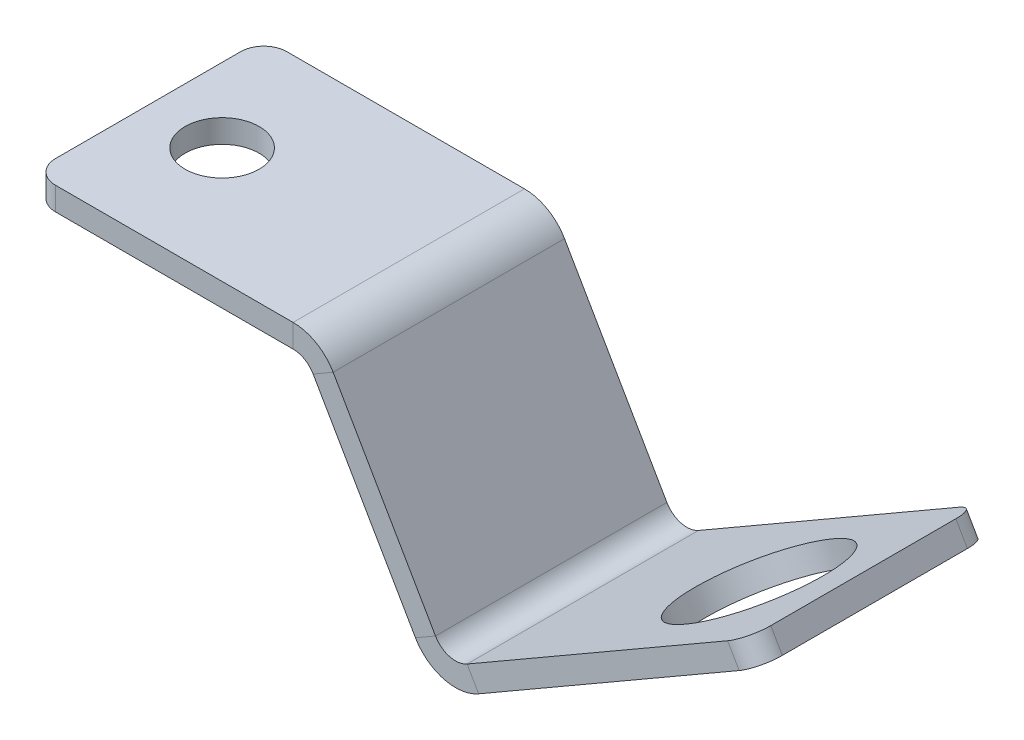
ISO-10303-21;
HEADER;
FILE_DESCRIPTION(('STEP AP214'),'2;1');
FILE_NAME('part.step','',(''),(''),'','','');
FILE_SCHEMA(('AUTOMOTIVE_DESIGN { 1 0 10303 214 1 1 1 1 }'));
ENDSEC;
DATA;
#1=APPLICATION_CONTEXT('core data for automotive mechanical design processes');
#2=APPLICATION_PROTOCOL_DEFINITION('international standard','automotive_design',2000,#1);
#3=PRODUCT_CONTEXT('',#1,'mechanical');
#4=PRODUCT('Part','Part','',(#3));
#5=PRODUCT_RELATED_PRODUCT_CATEGORY('part','',(#4));
#6=PRODUCT_DEFINITION_FORMATION('','',#4);
#7=PRODUCT_DEFINITION_CONTEXT('part definition',#1,'design');
#8=PRODUCT_DEFINITION('design','',#6,#7);
#9=PRODUCT_DEFINITION_SHAPE('','',#8);
#10=(LENGTH_UNIT() NAMED_UNIT(*) SI_UNIT(.MILLI.,.METRE.));
#11=(NAMED_UNIT(*) PLANE_ANGLE_UNIT() SI_UNIT($,.RADIAN.));
#12=(NAMED_UNIT(*) SI_UNIT($,.STERADIAN.) SOLID_ANGLE_UNIT());
#13=UNCERTAINTY_MEASURE_WITH_UNIT(LENGTH_MEASURE(1.E-05),#10,'distance_accuracy_value','');
#14=(GEOMETRIC_REPRESENTATION_CONTEXT(3) GLOBAL_UNCERTAINTY_ASSIGNED_CONTEXT((#13)) GLOBAL_UNIT_ASSIGNED_CONTEXT((#10,
#11,#12)) REPRESENTATION_CONTEXT('',''));
#15=CARTESIAN_POINT('',(0.,0.,0.));
#16=DIRECTION('',(0.,0.,1.));
#17=DIRECTION('',(1.,0.,0.));
#18=AXIS2_PLACEMENT_3D('',#15,#16,#17);
#19=CARTESIAN_POINT('',(37.8544128953231,-32.995567884187,15.875));
#20=DIRECTION('',(0.,0.,-1.));
#21=DIRECTION('',(-1.,0.,0.));
#22=AXIS2_PLACEMENT_3D('',#19,#20,#21);
#23=PLANE('',#22);
#24=DIRECTION('',(-0.866025403784436,-0.500000000000005,0.));
#25=VECTOR('',#24,1.);
#26=CARTESIAN_POINT('',(34.6794128953231,-27.4963065701559,15.875));
#27=LINE('',#26,#25);
#28=CARTESIAN_POINT('',(34.6794128953231,-27.4963065701559,15.875));
#29=VERTEX_POINT('',#28);
#30=CARTESIAN_POINT('',(31.9297822383075,-29.0838065701559,15.875));
#31=VERTEX_POINT('',#30);
#32=EDGE_CURVE('E254',#29,#31,#27,.T.);
#33=ORIENTED_EDGE('',*,*,#32,.F.);
#34=DIRECTION('',(0.500000000000004,-0.866025403784436,0.));
#35=VECTOR('',#34,1.);
#36=CARTESIAN_POINT('',(13.1867661191536,9.73004963530073,15.875));
#37=LINE('',#36,#35);
#38=CARTESIAN_POINT('',(20.6375,-3.17499999999997,15.875));
#39=VERTEX_POINT('',#38);
#40=EDGE_CURVE('E262',#39,#29,#37,.T.);
#41=ORIENTED_EDGE('',*,*,#40,.F.);
#42=DIRECTION('',(-0.866025403784436,-0.500000000000004,0.));
#43=VECTOR('',#42,1.);
#44=CARTESIAN_POINT('',(17.8878693429844,-4.76249999999999,15.875));
#45=LINE('',#44,#43);
#46=CARTESIAN_POINT('',(17.8878693429844,-4.76249999999999,15.875));
#47=VERTEX_POINT('',#46);
#48=EDGE_CURVE('E273',#47,#39,#45,.F.);
#49=ORIENTED_EDGE('',*,*,#48,.F.);
#50=DIRECTION('',(-0.500000000000004,0.866025403784436,0.));
#51=VECTOR('',#50,1.);
#52=CARTESIAN_POINT('',(35.1047822383075,-34.583067884187,15.875));
#53=LINE('',#52,#51);
#54=EDGE_CURVE('E267',#47,#31,#53,.F.);
#55=ORIENTED_EDGE('',*,*,#54,.T.);
#56=EDGE_LOOP('',(#33,#41,#49,#55));
#57=FACE_BOUND('',#56,.T.);
#58=ADVANCED_FACE('F79',(#57),#23,.F.);
#59=CARTESIAN_POINT('',(19.7209564476615,-1.58749999999999,-15.875));
#60=DIRECTION('',(0.,0.,1.));
#61=DIRECTION('',(1.,0.,0.));
#62=AXIS2_PLACEMENT_3D('',#59,#60,#61);
#63=PLANE('',#62);
#64=DIRECTION('',(-0.866025403784436,-0.500000000000005,0.));
#65=VECTOR('',#64,1.);
#66=CARTESIAN_POINT('',(34.6794128953231,-27.4963065701559,-15.875));
#67=LINE('',#66,#65);
#68=CARTESIAN_POINT('',(34.6794128953231,-27.4963065701559,-15.875));
#69=VERTEX_POINT('',#68);
#70=CARTESIAN_POINT('',(31.9297822383075,-29.0838065701559,-15.875));
#71=VERTEX_POINT('',#70);
#72=EDGE_CURVE('E247',#69,#71,#67,.T.);
#73=ORIENTED_EDGE('',*,*,#72,.T.);
#74=DIRECTION('',(0.500000000000004,-0.866025403784436,0.));
#75=VECTOR('',#74,1.);
#76=CARTESIAN_POINT('',(16.9713257906459,-3.175,-15.875));
#77=LINE('',#76,#75);
#78=CARTESIAN_POINT('',(17.8878693429844,-4.76249999999999,-15.875));
#79=VERTEX_POINT('',#78);
#80=EDGE_CURVE('E265',#71,#79,#77,.F.);
#81=ORIENTED_EDGE('',*,*,#80,.T.);
#82=DIRECTION('',(-0.866025403784436,-0.500000000000004,0.));
#83=VECTOR('',#82,1.);
#84=CARTESIAN_POINT('',(20.6375,-3.17499999999997,-15.875));
#85=LINE('',#84,#83);
#86=CARTESIAN_POINT('',(20.6375,-3.17499999999997,-15.875));
#87=VERTEX_POINT('',#86);
#88=EDGE_CURVE('E257',#79,#87,#85,.F.);
#89=ORIENTED_EDGE('',*,*,#88,.T.);
#90=DIRECTION('',(-0.500000000000004,0.866025403784436,0.));
#91=VECTOR('',#90,1.);
#92=CARTESIAN_POINT('',(13.1867661191536,9.73004963530073,-15.875));
#93=LINE('',#92,#91);
#94=EDGE_CURVE('E259',#69,#87,#93,.T.);
#95=ORIENTED_EDGE('',*,*,#94,.F.);
#96=EDGE_LOOP('',(#73,#81,#89,#95));
#97=FACE_BOUND('',#96,.T.);
#98=ADVANCED_FACE('F394',(#97),#63,.F.);
#99=CARTESIAN_POINT('',(13.1867661191536,9.73004963530073,0.));
#100=DIRECTION('',(-0.866025403784436,-0.500000000000004,0.));
#101=DIRECTION('',(0.500000000000004,-0.866025403784436,0.));
#102=AXIS2_PLACEMENT_3D('',#99,#100,#101);
#103=PLANE('',#102);
#104=DIRECTION('',(0.,0.,-1.));
#105=VECTOR('',#104,1.);
#106=CARTESIAN_POINT('',(34.6794128953231,-27.4963065701559,-15.875));
#107=LINE('',#106,#105);
#108=EDGE_CURVE('E251',#69,#29,#107,.F.);
#109=ORIENTED_EDGE('',*,*,#108,.F.);
#110=ORIENTED_EDGE('',*,*,#94,.T.);
#111=DIRECTION('',(0.,0.,1.));
#112=VECTOR('',#111,1.);
#113=CARTESIAN_POINT('',(20.6375,-3.17499999999997,-15.875));
#114=LINE('',#113,#112);
#115=EDGE_CURVE('E270',#39,#87,#114,.F.);
#116=ORIENTED_EDGE('',*,*,#115,.F.);
#117=ORIENTED_EDGE('',*,*,#40,.T.);
#118=EDGE_LOOP('',(#109,#110,#116,#117));
#119=FACE_BOUND('',#118,.T.);
#120=ADVANCED_FACE('F386',(#119),#103,.F.);
#121=CARTESIAN_POINT('',(10.437135462138,8.14254963530071,0.));
#122=DIRECTION('',(-0.866025403784436,-0.500000000000004,0.));
#123=DIRECTION('',(0.500000000000004,-0.866025403784436,0.));
#124=AXIS2_PLACEMENT_3D('',#121,#122,#123);
#125=PLANE('',#124);
#126=ORIENTED_EDGE('',*,*,#80,.F.);
#127=DIRECTION('',(0.,0.,-1.));
#128=VECTOR('',#127,1.);
#129=CARTESIAN_POINT('',(31.9297822383075,-29.0838065701559,-15.875));
#130=LINE('',#129,#128);
#131=EDGE_CURVE('E199',#71,#31,#130,.F.);
#132=ORIENTED_EDGE('',*,*,#131,.T.);
#133=ORIENTED_EDGE('',*,*,#54,.F.);
#134=DIRECTION('',(0.,0.,1.));
#135=VECTOR('',#134,1.);
#136=CARTESIAN_POINT('',(17.8878693429844,-4.76249999999999,-15.875));
#137=LINE('',#136,#135);
#138=EDGE_CURVE('E276',#79,#47,#137,.T.);
#139=ORIENTED_EDGE('',*,*,#138,.F.);
#140=EDGE_LOOP('',(#126,#132,#133,#139));
#141=FACE_BOUND('',#140,.T.);
#142=ADVANCED_FACE('F379',(#141),#125,.T.);
#143=CARTESIAN_POINT('',(-20.6375,-3.175,15.875));
#144=DIRECTION('',(0.,0.,1.));
#145=DIRECTION('',(1.,0.,0.));
#146=AXIS2_PLACEMENT_3D('',#143,#144,#145);
#147=PLANE('',#146);
#148=DIRECTION('',(1.,0.,0.));
#149=VECTOR('',#148,1.);
#150=CARTESIAN_POINT('',(-20.6375,0.,15.875));
#151=LINE('',#150,#149);
#152=CARTESIAN_POINT('',(-17.4625,0.,15.875));
#153=VERTEX_POINT('',#152);
#154=CARTESIAN_POINT('',(15.1382386859688,0.,15.875));
#155=VERTEX_POINT('',#154);
#156=EDGE_CURVE('E314',#153,#155,#151,.T.);
#157=ORIENTED_EDGE('',*,*,#156,.F.);
#158=DIRECTION('',(0.,1.,0.));
#159=VECTOR('',#158,1.);
#160=CARTESIAN_POINT('',(-17.4625,-3.175,15.875));
#161=LINE('',#160,#159);
#162=CARTESIAN_POINT('',(-17.4625,-3.175,15.875));
#163=VERTEX_POINT('',#162);
#164=EDGE_CURVE('E13',#153,#163,#161,.F.);
#165=ORIENTED_EDGE('',*,*,#164,.T.);
#166=DIRECTION('',(1.,0.,0.));
#167=VECTOR('',#166,1.);
#168=CARTESIAN_POINT('',(-20.6375,-3.175,15.875));
#169=LINE('',#168,#167);
#170=CARTESIAN_POINT('',(15.1382386859688,-3.175,15.875));
#171=VERTEX_POINT('',#170);
#172=EDGE_CURVE('E305',#163,#171,#169,.T.);
#173=ORIENTED_EDGE('',*,*,#172,.T.);
#174=DIRECTION('',(0.,1.,0.));
#175=VECTOR('',#174,1.);
#176=CARTESIAN_POINT('',(15.1382386859688,-3.175,15.875));
#177=LINE('',#176,#175);
#178=EDGE_CURVE('E287',#171,#155,#177,.T.);
#179=ORIENTED_EDGE('',*,*,#178,.T.);
#180=EDGE_LOOP('',(#157,#165,#173,#179));
#181=FACE_BOUND('',#180,.T.);
#182=ADVANCED_FACE('F366',(#181),#147,.T.);
#183=CARTESIAN_POINT('',(0.,-3.175,0.));
#184=DIRECTION('',(0.,1.,0.));
#185=DIRECTION('',(0.,0.,1.));
#186=AXIS2_PLACEMENT_3D('',#183,#184,#185);
#187=PLANE('',#186);
#188=CARTESIAN_POINT('',(-10.4775,-3.175,0.));
#189=DIRECTION('',(0.,1.,0.));
#190=DIRECTION('',(0.,0.,1.));
#191=AXIS2_PLACEMENT_3D('',#188,#189,#190);
#192=CIRCLE('',#191,5.08);
#193=CARTESIAN_POINT('',(-10.4775,-3.175,5.08));
#194=VERTEX_POINT('',#193);
#195=EDGE_CURVE('E244',#194,#194,#192,.T.);
#196=ORIENTED_EDGE('',*,*,#195,.T.);
#197=EDGE_LOOP('',(#196));
#198=FACE_BOUND('',#197,.T.);
#199=DIRECTION('',(0.,0.,1.));
#200=VECTOR('',#199,1.);
#201=CARTESIAN_POINT('',(-20.6375,-3.175,-15.875));
#202=LINE('',#201,#200);
#203=CARTESIAN_POINT('',(-20.6375,-3.175,-12.7));
#204=VERTEX_POINT('',#203);
#205=CARTESIAN_POINT('',(-20.6375,-3.175,12.7));
#206=VERTEX_POINT('',#205);
#207=EDGE_CURVE('E303',#204,#206,#202,.T.);
#208=ORIENTED_EDGE('',*,*,#207,.F.);
#209=CARTESIAN_POINT('',(-17.4625,-3.175,-12.7));
#210=DIRECTION('',(0.,1.,0.));
#211=DIRECTION('',(0.,0.,1.));
#212=AXIS2_PLACEMENT_3D('',#209,#210,#211);
#213=CIRCLE('',#212,3.175);
#214=CARTESIAN_POINT('',(-17.4625,-3.175,-15.875));
#215=VERTEX_POINT('',#214);
#216=EDGE_CURVE('E87',#204,#215,#213,.F.);
#217=ORIENTED_EDGE('',*,*,#216,.T.);
#218=DIRECTION('',(-1.,0.,0.));
#219=VECTOR('',#218,1.);
#220=CARTESIAN_POINT('',(-20.6375,-3.175,-15.875));
#221=LINE('',#220,#219);
#222=CARTESIAN_POINT('',(15.1382386859688,-3.175,-15.875));
#223=VERTEX_POINT('',#222);
#224=EDGE_CURVE('E308',#223,#215,#221,.T.);
#225=ORIENTED_EDGE('',*,*,#224,.F.);
#226=DIRECTION('',(0.,0.,1.));
#227=VECTOR('',#226,1.);
#228=CARTESIAN_POINT('',(15.1382386859688,-3.175,15.875));
#229=LINE('',#228,#227);
#230=EDGE_CURVE('E293',#171,#223,#229,.F.);
#231=ORIENTED_EDGE('',*,*,#230,.F.);
#232=ORIENTED_EDGE('',*,*,#172,.F.);
#233=CARTESIAN_POINT('',(-17.4625,-3.175,12.7));
#234=DIRECTION('',(0.,1.,0.));
#235=DIRECTION('',(0.,0.,1.));
#236=AXIS2_PLACEMENT_3D('',#233,#234,#235);
#237=CIRCLE('',#236,3.175);
#238=EDGE_CURVE('E99',#163,#206,#237,.F.);
#239=ORIENTED_EDGE('',*,*,#238,.T.);
#240=EDGE_LOOP('',(#208,#217,#225,#231,#232,#239));
#241=FACE_BOUND('',#240,.T.);
#242=ADVANCED_FACE('F348',(#198,#241),#187,.F.);
#243=CARTESIAN_POINT('',(0.,0.,0.));
#244=DIRECTION('',(0.,1.,0.));
#245=DIRECTION('',(0.,0.,1.));
#246=AXIS2_PLACEMENT_3D('',#243,#244,#245);
#247=PLANE('',#246);
#248=CARTESIAN_POINT('',(-10.4775,0.,0.));
#249=DIRECTION('',(0.,1.,0.));
#250=DIRECTION('',(0.,0.,1.));
#251=AXIS2_PLACEMENT_3D('',#248,#249,#250);
#252=CIRCLE('',#251,5.08);
#253=CARTESIAN_POINT('',(-10.4775,0.,5.08));
#254=VERTEX_POINT('',#253);
#255=EDGE_CURVE('E418',#254,#254,#252,.T.);
#256=ORIENTED_EDGE('',*,*,#255,.F.);
#257=EDGE_LOOP('',(#256));
#258=FACE_BOUND('',#257,.T.);
#259=DIRECTION('',(-1.,0.,0.));
#260=VECTOR('',#259,1.);
#261=CARTESIAN_POINT('',(-20.6375,0.,-15.875));
#262=LINE('',#261,#260);
#263=CARTESIAN_POINT('',(15.1382386859688,0.,-15.875));
#264=VERTEX_POINT('',#263);
#265=CARTESIAN_POINT('',(-17.4625,0.,-15.875));
#266=VERTEX_POINT('',#265);
#267=EDGE_CURVE('E306',#264,#266,#262,.T.);
#268=ORIENTED_EDGE('',*,*,#267,.T.);
#269=CARTESIAN_POINT('',(-17.4625,0.,-12.7));
#270=DIRECTION('',(0.,1.,0.));
#271=DIRECTION('',(0.,0.,1.));
#272=AXIS2_PLACEMENT_3D('',#269,#270,#271);
#273=CIRCLE('',#272,3.175);
#274=CARTESIAN_POINT('',(-20.6375,0.,-12.7));
#275=VERTEX_POINT('',#274);
#276=EDGE_CURVE('E339',#266,#275,#273,.T.);
#277=ORIENTED_EDGE('',*,*,#276,.T.);
#278=DIRECTION('',(0.,0.,1.));
#279=VECTOR('',#278,1.);
#280=CARTESIAN_POINT('',(-20.6375,0.,-15.875));
#281=LINE('',#280,#279);
#282=CARTESIAN_POINT('',(-20.6375,0.,12.7));
#283=VERTEX_POINT('',#282);
#284=EDGE_CURVE('E300',#275,#283,#281,.T.);
#285=ORIENTED_EDGE('',*,*,#284,.T.);
#286=CARTESIAN_POINT('',(-17.4625,0.,12.7));
#287=DIRECTION('',(0.,1.,0.));
#288=DIRECTION('',(0.,0.,1.));
#289=AXIS2_PLACEMENT_3D('',#286,#287,#288);
#290=CIRCLE('',#289,3.175);
#291=EDGE_CURVE('E337',#283,#153,#290,.T.);
#292=ORIENTED_EDGE('',*,*,#291,.T.);
#293=ORIENTED_EDGE('',*,*,#156,.T.);
#294=DIRECTION('',(0.,0.,1.));
#295=VECTOR('',#294,1.);
#296=CARTESIAN_POINT('',(15.1382386859688,0.,15.875));
#297=LINE('',#296,#295);
#298=EDGE_CURVE('E280',#155,#264,#297,.F.);
#299=ORIENTED_EDGE('',*,*,#298,.T.);
#300=EDGE_LOOP('',(#268,#277,#285,#292,#293,#299));
#301=FACE_BOUND('',#300,.T.);
#302=ADVANCED_FACE('F360',(#258,#301),#247,.T.);
#303=CARTESIAN_POINT('',(-20.6375,-3.175,-15.875));
#304=DIRECTION('',(-1.,0.,0.));
#305=DIRECTION('',(0.,0.,1.));
#306=AXIS2_PLACEMENT_3D('',#303,#304,#305);
#307=PLANE('',#306);
#308=ORIENTED_EDGE('',*,*,#284,.F.);
#309=DIRECTION('',(0.,1.,0.));
#310=VECTOR('',#309,1.);
#311=CARTESIAN_POINT('',(-20.6375,-3.175,-12.7));
#312=LINE('',#311,#310);
#313=EDGE_CURVE('E344',#275,#204,#312,.F.);
#314=ORIENTED_EDGE('',*,*,#313,.T.);
#315=ORIENTED_EDGE('',*,*,#207,.T.);
#316=DIRECTION('',(0.,1.,0.));
#317=VECTOR('',#316,1.);
#318=CARTESIAN_POINT('',(-20.6375,-3.175,12.7));
#319=LINE('',#318,#317);
#320=EDGE_CURVE('E341',#206,#283,#319,.T.);
#321=ORIENTED_EDGE('',*,*,#320,.T.);
#322=EDGE_LOOP('',(#308,#314,#315,#321));
#323=FACE_BOUND('',#322,.T.);
#324=ADVANCED_FACE('F362',(#323),#307,.T.);
#325=CARTESIAN_POINT('',(-20.6375,-3.175,-15.875));
#326=DIRECTION('',(0.,0.,-1.));
#327=DIRECTION('',(-1.,0.,0.));
#328=AXIS2_PLACEMENT_3D('',#325,#326,#327);
#329=PLANE('',#328);
#330=ORIENTED_EDGE('',*,*,#224,.T.);
#331=DIRECTION('',(0.,1.,0.));
#332=VECTOR('',#331,1.);
#333=CARTESIAN_POINT('',(-17.4625,-3.175,-15.875));
#334=LINE('',#333,#332);
#335=EDGE_CURVE('E334',#215,#266,#334,.T.);
#336=ORIENTED_EDGE('',*,*,#335,.T.);
#337=ORIENTED_EDGE('',*,*,#267,.F.);
#338=DIRECTION('',(0.,1.,0.));
#339=VECTOR('',#338,1.);
#340=CARTESIAN_POINT('',(15.1382386859688,-3.175,-15.875));
#341=LINE('',#340,#339);
#342=EDGE_CURVE('E297',#223,#264,#341,.T.);
#343=ORIENTED_EDGE('',*,*,#342,.F.);
#344=EDGE_LOOP('',(#330,#336,#337,#343));
#345=FACE_BOUND('',#344,.T.);
#346=ADVANCED_FACE('F355',(#345),#329,.T.);
#347=CARTESIAN_POINT('',(15.1382386859688,-6.35,-15.875));
#348=DIRECTION('',(0.,0.,-1.));
#349=DIRECTION('',(-1.,0.,0.));
#350=AXIS2_PLACEMENT_3D('',#347,#348,#349);
#351=PLANE('',#350);
#352=ORIENTED_EDGE('',*,*,#88,.F.);
#353=CARTESIAN_POINT('',(15.1382386859688,-6.35,-15.875));
#354=DIRECTION('',(0.,0.,1.));
#355=DIRECTION('',(1.,0.,0.));
#356=AXIS2_PLACEMENT_3D('',#353,#354,#355);
#357=CIRCLE('',#356,3.175);
#358=EDGE_CURVE('E290',#223,#79,#357,.F.);
#359=ORIENTED_EDGE('',*,*,#358,.F.);
#360=ORIENTED_EDGE('',*,*,#342,.T.);
#361=CARTESIAN_POINT('',(15.1382386859688,-6.35,-15.875));
#362=DIRECTION('',(0.,0.,1.));
#363=DIRECTION('',(1.,0.,0.));
#364=AXIS2_PLACEMENT_3D('',#361,#362,#363);
#365=CIRCLE('',#364,6.35);
#366=EDGE_CURVE('E283',#264,#87,#365,.F.);
#367=ORIENTED_EDGE('',*,*,#366,.T.);
#368=EDGE_LOOP('',(#352,#359,#360,#367));
#369=FACE_BOUND('',#368,.T.);
#370=ADVANCED_FACE('F392',(#369),#351,.T.);
#371=CARTESIAN_POINT('',(15.1382386859688,-6.35,15.875));
#372=DIRECTION('',(0.,0.,-1.));
#373=DIRECTION('',(-1.,0.,0.));
#374=AXIS2_PLACEMENT_3D('',#371,#372,#373);
#375=PLANE('',#374);
#376=CARTESIAN_POINT('',(15.1382386859688,-6.35,15.875));
#377=DIRECTION('',(0.,0.,1.));
#378=DIRECTION('',(1.,0.,0.));
#379=AXIS2_PLACEMENT_3D('',#376,#377,#378);
#380=CIRCLE('',#379,3.175);
#381=EDGE_CURVE('E261',#47,#171,#380,.T.);
#382=ORIENTED_EDGE('',*,*,#381,.F.);
#383=ORIENTED_EDGE('',*,*,#48,.T.);
#384=CARTESIAN_POINT('',(15.1382386859688,-6.35,15.875));
#385=DIRECTION('',(0.,0.,1.));
#386=DIRECTION('',(1.,0.,0.));
#387=AXIS2_PLACEMENT_3D('',#384,#385,#386);
#388=CIRCLE('',#387,6.35);
#389=EDGE_CURVE('E284',#39,#155,#388,.T.);
#390=ORIENTED_EDGE('',*,*,#389,.T.);
#391=ORIENTED_EDGE('',*,*,#178,.F.);
#392=EDGE_LOOP('',(#382,#383,#390,#391));
#393=FACE_BOUND('',#392,.T.);
#394=ADVANCED_FACE('F370',(#393),#375,.F.);
#395=CARTESIAN_POINT('',(15.1382386859688,-6.35,15.875));
#396=DIRECTION('',(0.,0.,1.));
#397=DIRECTION('',(0.866025403784436,0.500000000000004,0.));
#398=AXIS2_PLACEMENT_3D('',#395,#396,#397);
#399=CYLINDRICAL_SURFACE('',#398,6.35);
#400=ORIENTED_EDGE('',*,*,#298,.F.);
#401=ORIENTED_EDGE('',*,*,#389,.F.);
#402=ORIENTED_EDGE('',*,*,#115,.T.);
#403=ORIENTED_EDGE('',*,*,#366,.F.);
#404=EDGE_LOOP('',(#400,#401,#402,#403));
#405=FACE_BOUND('',#404,.T.);
#406=ADVANCED_FACE('F389',(#405),#399,.T.);
#407=CARTESIAN_POINT('',(15.1382386859688,-6.35,15.875));
#408=DIRECTION('',(0.,0.,1.));
#409=DIRECTION('',(0.866025403784436,0.500000000000004,0.));
#410=AXIS2_PLACEMENT_3D('',#407,#408,#409);
#411=CYLINDRICAL_SURFACE('',#410,3.175);
#412=ORIENTED_EDGE('',*,*,#230,.T.);
#413=ORIENTED_EDGE('',*,*,#358,.T.);
#414=ORIENTED_EDGE('',*,*,#138,.T.);
#415=ORIENTED_EDGE('',*,*,#381,.T.);
#416=EDGE_LOOP('',(#412,#413,#414,#415));
#417=FACE_BOUND('',#416,.T.);
#418=ADVANCED_FACE('F373',(#417),#411,.F.);
#419=CARTESIAN_POINT('',(37.4290435523386,-25.9088065701559,15.875));
#420=DIRECTION('',(0.,0.,1.));
#421=DIRECTION('',(1.,0.,0.));
#422=AXIS2_PLACEMENT_3D('',#419,#420,#421);
#423=PLANE('',#422);
#424=DIRECTION('',(-0.500000000000001,0.866025403784438,0.));
#425=VECTOR('',#424,1.);
#426=CARTESIAN_POINT('',(40.6040435523387,-31.408067884187,15.875));
#427=LINE('',#426,#425);
#428=CARTESIAN_POINT('',(39.0165435523386,-28.6584372271715,15.875));
#429=VERTEX_POINT('',#428);
#430=CARTESIAN_POINT('',(40.6040435523387,-31.408067884187,15.875));
#431=VERTEX_POINT('',#430);
#432=EDGE_CURVE('E241',#429,#431,#427,.F.);
#433=ORIENTED_EDGE('',*,*,#432,.F.);
#434=CARTESIAN_POINT('',(37.4290435523386,-25.9088065701559,15.875));
#435=DIRECTION('',(0.,0.,-1.));
#436=DIRECTION('',(-1.,0.,0.));
#437=AXIS2_PLACEMENT_3D('',#434,#435,#436);
#438=CIRCLE('',#437,3.175);
#439=EDGE_CURVE('E202',#29,#429,#438,.F.);
#440=ORIENTED_EDGE('',*,*,#439,.F.);
#441=ORIENTED_EDGE('',*,*,#32,.T.);
#442=CARTESIAN_POINT('',(37.4290435523386,-25.9088065701559,15.875));
#443=DIRECTION('',(0.,0.,-1.));
#444=DIRECTION('',(-1.,0.,0.));
#445=AXIS2_PLACEMENT_3D('',#442,#443,#444);
#446=CIRCLE('',#445,6.35);
#447=EDGE_CURVE('E246',#31,#431,#446,.F.);
#448=ORIENTED_EDGE('',*,*,#447,.T.);
#449=EDGE_LOOP('',(#433,#440,#441,#448));
#450=FACE_BOUND('',#449,.T.);
#451=ADVANCED_FACE('F459',(#450),#423,.T.);
#452=CARTESIAN_POINT('',(37.4290435523386,-25.9088065701559,-15.875));
#453=DIRECTION('',(0.,0.,1.));
#454=DIRECTION('',(1.,0.,0.));
#455=AXIS2_PLACEMENT_3D('',#452,#453,#454);
#456=PLANE('',#455);
#457=CARTESIAN_POINT('',(37.4290435523386,-25.9088065701559,-15.875));
#458=DIRECTION('',(0.,0.,-1.));
#459=DIRECTION('',(-1.,0.,0.));
#460=AXIS2_PLACEMENT_3D('',#457,#458,#459);
#461=CIRCLE('',#460,3.175);
#462=CARTESIAN_POINT('',(39.0165435523386,-28.6584372271715,-15.875));
#463=VERTEX_POINT('',#462);
#464=EDGE_CURVE('E209',#463,#69,#461,.T.);
#465=ORIENTED_EDGE('',*,*,#464,.F.);
#466=DIRECTION('',(-0.500000000000001,0.866025403784438,0.));
#467=VECTOR('',#466,1.);
#468=CARTESIAN_POINT('',(39.0165435523386,-28.6584372271715,-15.875));
#469=LINE('',#468,#467);
#470=CARTESIAN_POINT('',(40.6040435523387,-31.408067884187,-15.875));
#471=VERTEX_POINT('',#470);
#472=EDGE_CURVE('E206',#463,#471,#469,.F.);
#473=ORIENTED_EDGE('',*,*,#472,.T.);
#474=CARTESIAN_POINT('',(37.4290435523386,-25.9088065701559,-15.875));
#475=DIRECTION('',(0.,0.,-1.));
#476=DIRECTION('',(-1.,0.,0.));
#477=AXIS2_PLACEMENT_3D('',#474,#475,#476);
#478=CIRCLE('',#477,6.35);
#479=EDGE_CURVE('E192',#471,#71,#478,.T.);
#480=ORIENTED_EDGE('',*,*,#479,.T.);
#481=ORIENTED_EDGE('',*,*,#72,.F.);
#482=EDGE_LOOP('',(#465,#473,#480,#481));
#483=FACE_BOUND('',#482,.T.);
#484=ADVANCED_FACE('F207',(#483),#456,.F.);
#485=CARTESIAN_POINT('',(37.4290435523386,-25.9088065701559,-15.875));
#486=DIRECTION('',(0.,0.,-1.));
#487=DIRECTION('',(0.500000000000001,-0.866025403784438,0.));
#488=AXIS2_PLACEMENT_3D('',#485,#486,#487);
#489=CYLINDRICAL_SURFACE('',#488,6.35);
#490=ORIENTED_EDGE('',*,*,#131,.F.);
#491=ORIENTED_EDGE('',*,*,#479,.F.);
#492=DIRECTION('',(0.,0.,-1.));
#493=VECTOR('',#492,1.);
#494=CARTESIAN_POINT('',(40.6040435523387,-31.408067884187,15.875));
#495=LINE('',#494,#493);
#496=EDGE_CURVE('E196',#471,#431,#495,.F.);
#497=ORIENTED_EDGE('',*,*,#496,.T.);
#498=ORIENTED_EDGE('',*,*,#447,.F.);
#499=EDGE_LOOP('',(#490,#491,#497,#498));
#500=FACE_BOUND('',#499,.T.);
#501=ADVANCED_FACE('F194',(#500),#489,.T.);
#502=CARTESIAN_POINT('',(37.4290435523386,-25.9088065701559,-15.875));
#503=DIRECTION('',(0.,0.,-1.));
#504=DIRECTION('',(0.500000000000001,-0.866025403784438,0.));
#505=AXIS2_PLACEMENT_3D('',#502,#503,#504);
#506=CYLINDRICAL_SURFACE('',#505,3.175);
#507=ORIENTED_EDGE('',*,*,#108,.T.);
#508=ORIENTED_EDGE('',*,*,#439,.T.);
#509=DIRECTION('',(0.,0.,-1.));
#510=VECTOR('',#509,1.);
#511=CARTESIAN_POINT('',(39.0165435523386,-28.6584372271715,15.875));
#512=LINE('',#511,#510);
#513=EDGE_CURVE('E214',#429,#463,#512,.T.);
#514=ORIENTED_EDGE('',*,*,#513,.T.);
#515=ORIENTED_EDGE('',*,*,#464,.T.);
#516=EDGE_LOOP('',(#507,#508,#514,#515));
#517=FACE_BOUND('',#516,.T.);
#518=ADVANCED_FACE('F396',(#517),#506,.F.);
#519=CARTESIAN_POINT('',(79.0988727505569,-9.18306788418698,-15.875));
#520=DIRECTION('',(0.,0.,1.));
#521=DIRECTION('',(1.,0.,0.));
#522=AXIS2_PLACEMENT_3D('',#519,#520,#521);
#523=PLANE('',#522);
#524=DIRECTION('',(-0.866025403784438,-0.500000000000001,0.));
#525=VECTOR('',#524,1.);
#526=CARTESIAN_POINT('',(77.5113727505569,-6.4334372271714,-15.875));
#527=LINE('',#526,#525);
#528=CARTESIAN_POINT('',(74.7617420935413,-8.02093722717139,-15.875));
#529=VERTEX_POINT('',#528);
#530=EDGE_CURVE('E223',#463,#529,#527,.F.);
#531=ORIENTED_EDGE('',*,*,#530,.T.);
#532=DIRECTION('',(-0.500000000000001,0.866025403784438,0.));
#533=VECTOR('',#532,1.);
#534=CARTESIAN_POINT('',(76.3492420935413,-10.770567884187,-15.875));
#535=LINE('',#534,#533);
#536=CARTESIAN_POINT('',(76.3492420935413,-10.770567884187,-15.875));
#537=VERTEX_POINT('',#536);
#538=EDGE_CURVE('E227',#529,#537,#535,.F.);
#539=ORIENTED_EDGE('',*,*,#538,.T.);
#540=DIRECTION('',(0.866025403784438,0.500000000000001,0.));
#541=VECTOR('',#540,1.);
#542=CARTESIAN_POINT('',(23.7511032238308,-41.1381175194878,-15.875));
#543=LINE('',#542,#541);
#544=EDGE_CURVE('E219',#471,#537,#543,.T.);
#545=ORIENTED_EDGE('',*,*,#544,.F.);
#546=ORIENTED_EDGE('',*,*,#472,.F.);
#547=EDGE_LOOP('',(#531,#539,#545,#546));
#548=FACE_BOUND('',#547,.T.);
#549=ADVANCED_FACE('F225',(#548),#523,.F.);
#550=CARTESIAN_POINT('',(37.8544128953231,-32.995567884187,15.875));
#551=DIRECTION('',(0.,0.,-1.));
#552=DIRECTION('',(-1.,0.,0.));
#553=AXIS2_PLACEMENT_3D('',#550,#551,#552);
#554=PLANE('',#553);
#555=DIRECTION('',(-0.866025403784438,-0.500000000000001,0.));
#556=VECTOR('',#555,1.);
#557=CARTESIAN_POINT('',(23.7511032238308,-41.1381175194878,15.875));
#558=LINE('',#557,#556);
#559=CARTESIAN_POINT('',(76.3492420935413,-10.770567884187,15.875));
#560=VERTEX_POINT('',#559);
#561=EDGE_CURVE('E222',#560,#431,#558,.T.);
#562=ORIENTED_EDGE('',*,*,#561,.F.);
#563=DIRECTION('',(-0.500000000000001,0.866025403784438,0.));
#564=VECTOR('',#563,1.);
#565=CARTESIAN_POINT('',(76.3492420935413,-10.770567884187,15.875));
#566=LINE('',#565,#564);
#567=CARTESIAN_POINT('',(74.7617420935413,-8.0209372271714,15.875));
#568=VERTEX_POINT('',#567);
#569=EDGE_CURVE('E331',#560,#568,#566,.T.);
#570=ORIENTED_EDGE('',*,*,#569,.T.);
#571=DIRECTION('',(0.866025403784438,0.500000000000001,0.));
#572=VECTOR('',#571,1.);
#573=CARTESIAN_POINT('',(36.2669128953231,-30.2459372271714,15.875));
#574=LINE('',#573,#572);
#575=EDGE_CURVE('E229',#568,#429,#574,.F.);
#576=ORIENTED_EDGE('',*,*,#575,.T.);
#577=ORIENTED_EDGE('',*,*,#432,.T.);
#578=EDGE_LOOP('',(#562,#570,#576,#577));
#579=FACE_BOUND('',#578,.T.);
#580=ADVANCED_FACE('F415',(#579),#554,.F.);
#581=CARTESIAN_POINT('',(23.7511032238308,-41.1381175194878,0.));
#582=DIRECTION('',(-0.500000000000001,0.866025403784438,0.));
#583=DIRECTION('',(-0.866025403784438,-0.500000000000001,0.));
#584=AXIS2_PLACEMENT_3D('',#581,#582,#583);
#585=PLANE('',#584);
#586=CARTESIAN_POINT('',(64.8007933340759,-17.438067884187,0.));
#587=DIRECTION('',(-0.500000000000001,0.866025403784438,0.));
#588=DIRECTION('',(-0.866025403784438,-0.500000000000001,0.));
#589=AXIS2_PLACEMENT_3D('',#586,#587,#588);
#590=CIRCLE('',#589,10.16);
#591=CARTESIAN_POINT('',(56.001975231626,-22.518067884187,0.));
#592=VERTEX_POINT('',#591);
#593=EDGE_CURVE('E421',#592,#592,#590,.T.);
#594=ORIENTED_EDGE('',*,*,#593,.T.);
#595=EDGE_LOOP('',(#594));
#596=FACE_BOUND('',#595,.T.);
#597=ORIENTED_EDGE('',*,*,#544,.T.);
#598=CARTESIAN_POINT('',(76.3492420935413,-10.770567884187,-12.7));
#599=DIRECTION('',(-0.500000000000001,0.866025403784438,0.));
#600=DIRECTION('',(-0.866025403784438,-0.500000000000001,0.));
#601=AXIS2_PLACEMENT_3D('',#598,#599,#600);
#602=CIRCLE('',#601,3.175);
#603=CARTESIAN_POINT('',(79.0988727505569,-9.18306788418698,-12.7));
#604=VERTEX_POINT('',#603);
#605=EDGE_CURVE('E329',#537,#604,#602,.F.);
#606=ORIENTED_EDGE('',*,*,#605,.T.);
#607=DIRECTION('',(0.,0.,1.));
#608=VECTOR('',#607,1.);
#609=CARTESIAN_POINT('',(79.0988727505569,-9.18306788418698,0.));
#610=LINE('',#609,#608);
#611=CARTESIAN_POINT('',(79.0988727505569,-9.18306788418698,12.7));
#612=VERTEX_POINT('',#611);
#613=EDGE_CURVE('E228',#604,#612,#610,.T.);
#614=ORIENTED_EDGE('',*,*,#613,.T.);
#615=CARTESIAN_POINT('',(76.3492420935413,-10.770567884187,12.7));
#616=DIRECTION('',(-0.500000000000001,0.866025403784438,0.));
#617=DIRECTION('',(-0.866025403784438,-0.500000000000001,0.));
#618=AXIS2_PLACEMENT_3D('',#615,#616,#617);
#619=CIRCLE('',#618,3.175);
#620=EDGE_CURVE('E327',#612,#560,#619,.F.);
#621=ORIENTED_EDGE('',*,*,#620,.T.);
#622=ORIENTED_EDGE('',*,*,#561,.T.);
#623=ORIENTED_EDGE('',*,*,#496,.F.);
#624=EDGE_LOOP('',(#597,#606,#614,#621,#622,#623));
#625=FACE_BOUND('',#624,.T.);
#626=ADVANCED_FACE('F218',(#596,#625),#585,.F.);
#627=CARTESIAN_POINT('',(22.1636032238308,-38.3884868624722,0.));
#628=DIRECTION('',(-0.500000000000001,0.866025403784438,0.));
#629=DIRECTION('',(-0.866025403784438,-0.500000000000001,0.));
#630=AXIS2_PLACEMENT_3D('',#627,#628,#629);
#631=PLANE('',#630);
#632=CARTESIAN_POINT('',(63.2132933340759,-14.6884372271714,0.));
#633=DIRECTION('',(-0.500000000000001,0.866025403784438,0.));
#634=DIRECTION('',(-0.866025403784438,-0.500000000000001,0.));
#635=AXIS2_PLACEMENT_3D('',#632,#633,#634);
#636=CIRCLE('',#635,10.16);
#637=CARTESIAN_POINT('',(54.414475231626,-19.7684372271714,0.));
#638=VERTEX_POINT('',#637);
#639=EDGE_CURVE('E424',#638,#638,#636,.T.);
#640=ORIENTED_EDGE('',*,*,#639,.F.);
#641=EDGE_LOOP('',(#640));
#642=FACE_BOUND('',#641,.T.);
#643=DIRECTION('',(0.,0.,-1.));
#644=VECTOR('',#643,1.);
#645=CARTESIAN_POINT('',(77.5113727505569,-6.4334372271714,15.875));
#646=LINE('',#645,#644);
#647=CARTESIAN_POINT('',(77.5113727505569,-6.4334372271714,-12.7));
#648=VERTEX_POINT('',#647);
#649=CARTESIAN_POINT('',(77.5113727505569,-6.4334372271714,12.7));
#650=VERTEX_POINT('',#649);
#651=EDGE_CURVE('E233',#648,#650,#646,.F.);
#652=ORIENTED_EDGE('',*,*,#651,.F.);
#653=CARTESIAN_POINT('',(74.7617420935413,-8.0209372271714,-12.7));
#654=DIRECTION('',(-0.500000000000001,0.866025403784438,0.));
#655=DIRECTION('',(-0.866025403784438,-0.500000000000001,0.));
#656=AXIS2_PLACEMENT_3D('',#653,#654,#655);
#657=CIRCLE('',#656,3.175);
#658=EDGE_CURVE('E324',#648,#529,#657,.T.);
#659=ORIENTED_EDGE('',*,*,#658,.T.);
#660=ORIENTED_EDGE('',*,*,#530,.F.);
#661=ORIENTED_EDGE('',*,*,#513,.F.);
#662=ORIENTED_EDGE('',*,*,#575,.F.);
#663=CARTESIAN_POINT('',(74.7617420935413,-8.0209372271714,12.7));
#664=DIRECTION('',(-0.500000000000001,0.866025403784438,0.));
#665=DIRECTION('',(-0.866025403784438,-0.500000000000001,0.));
#666=AXIS2_PLACEMENT_3D('',#663,#664,#665);
#667=CIRCLE('',#666,3.175);
#668=EDGE_CURVE('E322',#568,#650,#667,.T.);
#669=ORIENTED_EDGE('',*,*,#668,.T.);
#670=EDGE_LOOP('',(#652,#659,#660,#661,#662,#669));
#671=FACE_BOUND('',#670,.T.);
#672=ADVANCED_FACE('F402',(#642,#671),#631,.T.);
#673=CARTESIAN_POINT('',(79.0988727505569,-9.18306788418698,15.875));
#674=DIRECTION('',(-0.866025403784438,-0.500000000000001,0.));
#675=DIRECTION('',(0.500000000000001,-0.866025403784438,0.));
#676=AXIS2_PLACEMENT_3D('',#673,#674,#675);
#677=PLANE('',#676);
#678=ORIENTED_EDGE('',*,*,#613,.F.);
#679=DIRECTION('',(-0.500000000000001,0.866025403784438,0.));
#680=VECTOR('',#679,1.);
#681=CARTESIAN_POINT('',(79.0988727505569,-9.18306788418698,-12.7));
#682=LINE('',#681,#680);
#683=EDGE_CURVE('E319',#604,#648,#682,.T.);
#684=ORIENTED_EDGE('',*,*,#683,.T.);
#685=ORIENTED_EDGE('',*,*,#651,.T.);
#686=DIRECTION('',(-0.500000000000001,0.866025403784438,0.));
#687=VECTOR('',#686,1.);
#688=CARTESIAN_POINT('',(79.0988727505569,-9.18306788418698,12.7));
#689=LINE('',#688,#687);
#690=EDGE_CURVE('E311',#650,#612,#689,.F.);
#691=ORIENTED_EDGE('',*,*,#690,.T.);
#692=EDGE_LOOP('',(#678,#684,#685,#691));
#693=FACE_BOUND('',#692,.T.);
#694=ADVANCED_FACE('F409',(#693),#677,.F.);
#695=CARTESIAN_POINT('',(76.3492420935413,-10.770567884187,-12.7));
#696=DIRECTION('',(-0.500000000000001,0.866025403784438,0.));
#697=DIRECTION('',(-0.866025403784438,-0.500000000000001,0.));
#698=AXIS2_PLACEMENT_3D('',#695,#696,#697);
#699=CYLINDRICAL_SURFACE('',#698,3.175);
#700=ORIENTED_EDGE('',*,*,#605,.F.);
#701=ORIENTED_EDGE('',*,*,#538,.F.);
#702=ORIENTED_EDGE('',*,*,#658,.F.);
#703=ORIENTED_EDGE('',*,*,#683,.F.);
#704=EDGE_LOOP('',(#700,#701,#702,#703));
#705=FACE_BOUND('',#704,.T.);
#706=ADVANCED_FACE('F404',(#705),#699,.T.);
#707=CARTESIAN_POINT('',(76.3492420935413,-10.770567884187,12.7));
#708=DIRECTION('',(-0.500000000000001,0.866025403784438,0.));
#709=DIRECTION('',(-0.866025403784438,-0.500000000000001,0.));
#710=AXIS2_PLACEMENT_3D('',#707,#708,#709);
#711=CYLINDRICAL_SURFACE('',#710,3.175);
#712=ORIENTED_EDGE('',*,*,#620,.F.);
#713=ORIENTED_EDGE('',*,*,#690,.F.);
#714=ORIENTED_EDGE('',*,*,#668,.F.);
#715=ORIENTED_EDGE('',*,*,#569,.F.);
#716=EDGE_LOOP('',(#712,#713,#714,#715));
#717=FACE_BOUND('',#716,.T.);
#718=ADVANCED_FACE('F412',(#717),#711,.T.);
#719=CARTESIAN_POINT('',(-17.4625,-3.175,-12.7));
#720=DIRECTION('',(0.,1.,0.));
#721=DIRECTION('',(0.,0.,1.));
#722=AXIS2_PLACEMENT_3D('',#719,#720,#721);
#723=CYLINDRICAL_SURFACE('',#722,3.175);
#724=ORIENTED_EDGE('',*,*,#216,.F.);
#725=ORIENTED_EDGE('',*,*,#313,.F.);
#726=ORIENTED_EDGE('',*,*,#276,.F.);
#727=ORIENTED_EDGE('',*,*,#335,.F.);
#728=EDGE_LOOP('',(#724,#725,#726,#727));
#729=FACE_BOUND('',#728,.T.);
#730=ADVANCED_FACE('F357',(#729),#723,.T.);
#731=CARTESIAN_POINT('',(-17.4625,-3.175,12.7));
#732=DIRECTION('',(0.,1.,0.));
#733=DIRECTION('',(0.,0.,1.));
#734=AXIS2_PLACEMENT_3D('',#731,#732,#733);
#735=CYLINDRICAL_SURFACE('',#734,3.175);
#736=ORIENTED_EDGE('',*,*,#238,.F.);
#737=ORIENTED_EDGE('',*,*,#164,.F.);
#738=ORIENTED_EDGE('',*,*,#291,.F.);
#739=ORIENTED_EDGE('',*,*,#320,.F.);
#740=EDGE_LOOP('',(#736,#737,#738,#739));
#741=FACE_BOUND('',#740,.T.);
#742=ADVANCED_FACE('F81',(#741),#735,.T.);
#743=CARTESIAN_POINT('',(-10.4775,-3.175,0.));
#744=DIRECTION('',(0.,1.,0.));
#745=DIRECTION('',(0.,0.,1.));
#746=AXIS2_PLACEMENT_3D('',#743,#744,#745);
#747=CYLINDRICAL_SURFACE('',#746,5.08);
#748=ORIENTED_EDGE('',*,*,#195,.F.);
#749=EDGE_LOOP('',(#748));
#750=FACE_BOUND('',#749,.T.);
#751=ORIENTED_EDGE('',*,*,#255,.T.);
#752=EDGE_LOOP('',(#751));
#753=FACE_BOUND('',#752,.T.);
#754=ADVANCED_FACE('F434',(#750,#753),#747,.F.);
#755=CARTESIAN_POINT('',(64.8007933340759,-17.438067884187,0.));
#756=DIRECTION('',(-0.500000000000001,0.866025403784438,0.));
#757=DIRECTION('',(-0.866025403784438,-0.500000000000001,0.));
#758=AXIS2_PLACEMENT_3D('',#755,#756,#757);
#759=CYLINDRICAL_SURFACE('',#758,10.16);
#760=ORIENTED_EDGE('',*,*,#593,.F.);
#761=EDGE_LOOP('',(#760));
#762=FACE_BOUND('',#761,.T.);
#763=ORIENTED_EDGE('',*,*,#639,.T.);
#764=EDGE_LOOP('',(#763));
#765=FACE_BOUND('',#764,.T.);
#766=ADVANCED_FACE('F431',(#762,#765),#759,.F.);
#767=CLOSED_SHELL('',(#58,#98,#120,#142,#182,#242,#302,#324,#346,#370,#394,#406,#418,#451,#484,
#501,#518,#549,#580,#626,#672,#694,#706,#718,#730,#742,#754,#766));
#768=MANIFOLD_SOLID_BREP('B2',#767);
#769=ADVANCED_BREP_SHAPE_REPRESENTATION('',(#18,#768),#14);
#770=SHAPE_DEFINITION_REPRESENTATION(#9,#769);
ENDSEC;
END-ISO-10303-21;
